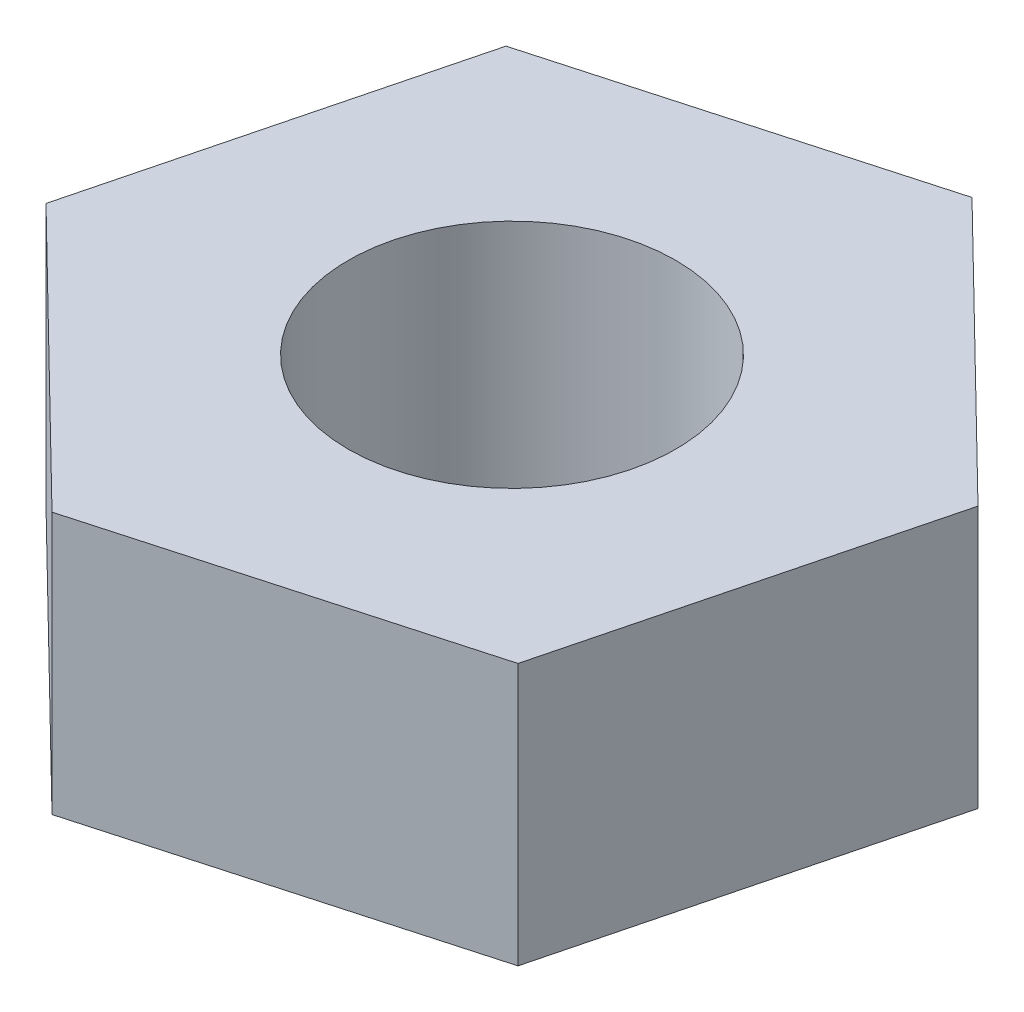
ISO-10303-21;
HEADER;
FILE_DESCRIPTION(('STEP AP214'),'2;1');
FILE_NAME('part.step','',(''),(''),'','','');
FILE_SCHEMA(('AUTOMOTIVE_DESIGN { 1 0 10303 214 1 1 1 1 }'));
ENDSEC;
DATA;
#1=APPLICATION_CONTEXT('core data for automotive mechanical design processes');
#2=APPLICATION_PROTOCOL_DEFINITION('international standard','automotive_design',2000,#1);
#3=PRODUCT_CONTEXT('',#1,'mechanical');
#4=PRODUCT('Part','Part','',(#3));
#5=PRODUCT_RELATED_PRODUCT_CATEGORY('part','',(#4));
#6=PRODUCT_DEFINITION_FORMATION('','',#4);
#7=PRODUCT_DEFINITION_CONTEXT('part definition',#1,'design');
#8=PRODUCT_DEFINITION('design','',#6,#7);
#9=PRODUCT_DEFINITION_SHAPE('','',#8);
#10=(LENGTH_UNIT() NAMED_UNIT(*) SI_UNIT(.MILLI.,.METRE.));
#11=(NAMED_UNIT(*) PLANE_ANGLE_UNIT() SI_UNIT($,.RADIAN.));
#12=(NAMED_UNIT(*) SI_UNIT($,.STERADIAN.) SOLID_ANGLE_UNIT());
#13=UNCERTAINTY_MEASURE_WITH_UNIT(LENGTH_MEASURE(1.E-05),#10,'distance_accuracy_value','');
#14=(GEOMETRIC_REPRESENTATION_CONTEXT(3) GLOBAL_UNCERTAINTY_ASSIGNED_CONTEXT((#13)) GLOBAL_UNIT_ASSIGNED_CONTEXT((#10,
#11,#12)) REPRESENTATION_CONTEXT('',''));
#15=CARTESIAN_POINT('',(0.,0.,0.));
#16=DIRECTION('',(0.,0.,1.));
#17=DIRECTION('',(1.,0.,0.));
#18=AXIS2_PLACEMENT_3D('',#15,#16,#17);
#19=CARTESIAN_POINT('',(0.,1.6,0.));
#20=DIRECTION('',(0.,1.,0.));
#21=DIRECTION('',(0.,0.,1.));
#22=AXIS2_PLACEMENT_3D('',#19,#20,#21);
#23=PLANE('',#22);
#24=DIRECTION('',(0.962956963986224,0.,-0.269655123278668));
#25=VECTOR('',#24,1.);
#26=CARTESIAN_POINT('',(-0.572616678193608,1.6,2.23728484399905));
#27=LINE('',#26,#25);
#28=CARTESIAN_POINT('',(-0.572616678193608,1.6,2.23728484399905));
#29=VERTEX_POINT('',#28);
#30=CARTESIAN_POINT('',(1.65123717130828,1.6,1.61454301194585));
#31=VERTEX_POINT('',#30);
#32=EDGE_CURVE('E146',#29,#31,#27,.T.);
#33=ORIENTED_EDGE('',*,*,#32,.T.);
#34=DIRECTION('',(0.247950294973161,0.,-0.968772755202541));
#35=VECTOR('',#34,1.);
#36=CARTESIAN_POINT('',(1.65123717130828,1.6,1.61454301194585));
#37=LINE('',#36,#35);
#38=CARTESIAN_POINT('',(2.22385384950188,1.6,-0.622741832053203));
#39=VERTEX_POINT('',#38);
#40=EDGE_CURVE('E94',#31,#39,#37,.T.);
#41=ORIENTED_EDGE('',*,*,#40,.T.);
#42=DIRECTION('',(-0.715006669013063,0.,-0.699117631923873));
#43=VECTOR('',#42,1.);
#44=CARTESIAN_POINT('',(2.22385384950188,1.6,-0.622741832053203));
#45=LINE('',#44,#43);
#46=CARTESIAN_POINT('',(0.572616678193607,1.6,-2.23728484399905));
#47=VERTEX_POINT('',#46);
#48=EDGE_CURVE('E107',#39,#47,#45,.T.);
#49=ORIENTED_EDGE('',*,*,#48,.T.);
#50=DIRECTION('',(-0.962956963986224,0.,0.269655123278668));
#51=VECTOR('',#50,1.);
#52=CARTESIAN_POINT('',(0.572616678193607,1.6,-2.23728484399905));
#53=LINE('',#52,#51);
#54=CARTESIAN_POINT('',(-1.65123717130828,1.6,-1.61454301194585));
#55=VERTEX_POINT('',#54);
#56=EDGE_CURVE('E101',#47,#55,#53,.T.);
#57=ORIENTED_EDGE('',*,*,#56,.T.);
#58=DIRECTION('',(-0.247950294973161,0.,0.968772755202541));
#59=VECTOR('',#58,1.);
#60=CARTESIAN_POINT('',(-1.65123717130828,1.6,-1.61454301194585));
#61=LINE('',#60,#59);
#62=CARTESIAN_POINT('',(-2.22385384950188,1.6,0.622741832053203));
#63=VERTEX_POINT('',#62);
#64=EDGE_CURVE('E105',#55,#63,#61,.T.);
#65=ORIENTED_EDGE('',*,*,#64,.T.);
#66=DIRECTION('',(0.715006669013063,0.,0.699117631923873));
#67=VECTOR('',#66,1.);
#68=CARTESIAN_POINT('',(-2.22385384950188,1.6,0.622741832053203));
#69=LINE('',#68,#67);
#70=EDGE_CURVE('E57',#63,#29,#69,.T.);
#71=ORIENTED_EDGE('',*,*,#70,.T.);
#72=EDGE_LOOP('',(#33,#41,#49,#57,#65,#71));
#73=FACE_BOUND('',#72,.T.);
#74=CARTESIAN_POINT('',(0.,1.6,0.));
#75=DIRECTION('',(0.,1.,0.));
#76=DIRECTION('',(0.,0.,1.));
#77=AXIS2_PLACEMENT_3D('',#74,#75,#76);
#78=CIRCLE('',#77,1.);
#79=CARTESIAN_POINT('',(0.,1.6,1.));
#80=VERTEX_POINT('',#79);
#81=EDGE_CURVE('E134',#80,#80,#78,.T.);
#82=ORIENTED_EDGE('',*,*,#81,.F.);
#83=EDGE_LOOP('',(#82));
#84=FACE_BOUND('',#83,.T.);
#85=ADVANCED_FACE('F39',(#73,#84),#23,.T.);
#86=CARTESIAN_POINT('',(0.,0.,0.));
#87=DIRECTION('',(0.,1.,0.));
#88=DIRECTION('',(0.,0.,1.));
#89=AXIS2_PLACEMENT_3D('',#86,#87,#88);
#90=PLANE('',#89);
#91=DIRECTION('',(0.962956963986224,0.,-0.269655123278668));
#92=VECTOR('',#91,1.);
#93=CARTESIAN_POINT('',(-0.572616678193608,0.,2.23728484399905));
#94=LINE('',#93,#92);
#95=CARTESIAN_POINT('',(-0.572616678193608,0.,2.23728484399905));
#96=VERTEX_POINT('',#95);
#97=CARTESIAN_POINT('',(1.65123717130828,0.,1.61454301194585));
#98=VERTEX_POINT('',#97);
#99=EDGE_CURVE('E129',#96,#98,#94,.T.);
#100=ORIENTED_EDGE('',*,*,#99,.F.);
#101=DIRECTION('',(0.715006669013063,0.,0.699117631923873));
#102=VECTOR('',#101,1.);
#103=CARTESIAN_POINT('',(-2.22385384950188,0.,0.622741832053203));
#104=LINE('',#103,#102);
#105=CARTESIAN_POINT('',(-2.22385384950188,0.,0.622741832053203));
#106=VERTEX_POINT('',#105);
#107=EDGE_CURVE('E86',#106,#96,#104,.T.);
#108=ORIENTED_EDGE('',*,*,#107,.F.);
#109=DIRECTION('',(-0.247950294973161,0.,0.968772755202541));
#110=VECTOR('',#109,1.);
#111=CARTESIAN_POINT('',(-1.65123717130828,0.,-1.61454301194585));
#112=LINE('',#111,#110);
#113=CARTESIAN_POINT('',(-1.65123717130828,0.,-1.61454301194585));
#114=VERTEX_POINT('',#113);
#115=EDGE_CURVE('E80',#114,#106,#112,.T.);
#116=ORIENTED_EDGE('',*,*,#115,.F.);
#117=DIRECTION('',(-0.962956963986224,0.,0.269655123278668));
#118=VECTOR('',#117,1.);
#119=CARTESIAN_POINT('',(0.572616678193607,0.,-2.23728484399905));
#120=LINE('',#119,#118);
#121=CARTESIAN_POINT('',(0.572616678193607,0.,-2.23728484399905));
#122=VERTEX_POINT('',#121);
#123=EDGE_CURVE('E116',#122,#114,#120,.T.);
#124=ORIENTED_EDGE('',*,*,#123,.F.);
#125=DIRECTION('',(-0.715006669013063,0.,-0.699117631923873));
#126=VECTOR('',#125,1.);
#127=CARTESIAN_POINT('',(2.22385384950188,0.,-0.622741832053203));
#128=LINE('',#127,#126);
#129=CARTESIAN_POINT('',(2.22385384950188,0.,-0.622741832053203));
#130=VERTEX_POINT('',#129);
#131=EDGE_CURVE('E137',#130,#122,#128,.T.);
#132=ORIENTED_EDGE('',*,*,#131,.F.);
#133=DIRECTION('',(0.247950294973161,0.,-0.968772755202541));
#134=VECTOR('',#133,1.);
#135=CARTESIAN_POINT('',(1.65123717130828,0.,1.61454301194585));
#136=LINE('',#135,#134);
#137=EDGE_CURVE('E133',#98,#130,#136,.T.);
#138=ORIENTED_EDGE('',*,*,#137,.F.);
#139=EDGE_LOOP('',(#100,#108,#116,#124,#132,#138));
#140=FACE_BOUND('',#139,.T.);
#141=CARTESIAN_POINT('',(0.,0.,0.));
#142=DIRECTION('',(0.,1.,0.));
#143=DIRECTION('',(0.,0.,1.));
#144=AXIS2_PLACEMENT_3D('',#141,#142,#143);
#145=CIRCLE('',#144,1.);
#146=CARTESIAN_POINT('',(0.,0.,1.));
#147=VERTEX_POINT('',#146);
#148=EDGE_CURVE('E243',#147,#147,#145,.T.);
#149=ORIENTED_EDGE('',*,*,#148,.T.);
#150=EDGE_LOOP('',(#149));
#151=FACE_BOUND('',#150,.T.);
#152=ADVANCED_FACE('F159',(#140,#151),#90,.F.);
#153=CARTESIAN_POINT('',(-0.572616678193608,1.6,2.23728484399905));
#154=DIRECTION('',(-0.269655123278668,0.,-0.962956963986224));
#155=DIRECTION('',(-0.962956963986224,0.,0.269655123278668));
#156=AXIS2_PLACEMENT_3D('',#153,#154,#155);
#157=PLANE('',#156);
#158=ORIENTED_EDGE('',*,*,#99,.T.);
#159=DIRECTION('',(0.,-1.,0.));
#160=VECTOR('',#159,1.);
#161=CARTESIAN_POINT('',(1.65123717130828,1.6,1.61454301194585));
#162=LINE('',#161,#160);
#163=EDGE_CURVE('E11',#31,#98,#162,.T.);
#164=ORIENTED_EDGE('',*,*,#163,.F.);
#165=ORIENTED_EDGE('',*,*,#32,.F.);
#166=DIRECTION('',(0.,-1.,0.));
#167=VECTOR('',#166,1.);
#168=CARTESIAN_POINT('',(-0.572616678193608,1.6,2.23728484399905));
#169=LINE('',#168,#167);
#170=EDGE_CURVE('E125',#29,#96,#169,.T.);
#171=ORIENTED_EDGE('',*,*,#170,.T.);
#172=EDGE_LOOP('',(#158,#164,#165,#171));
#173=FACE_BOUND('',#172,.T.);
#174=ADVANCED_FACE('F41',(#173),#157,.F.);
#175=CARTESIAN_POINT('',(1.65123717130828,1.6,1.61454301194585));
#176=DIRECTION('',(-0.968772755202541,0.,-0.247950294973161));
#177=DIRECTION('',(-0.247950294973161,0.,0.968772755202541));
#178=AXIS2_PLACEMENT_3D('',#175,#176,#177);
#179=PLANE('',#178);
#180=ORIENTED_EDGE('',*,*,#137,.T.);
#181=DIRECTION('',(0.,-1.,0.));
#182=VECTOR('',#181,1.);
#183=CARTESIAN_POINT('',(2.22385384950188,1.6,-0.622741832053203));
#184=LINE('',#183,#182);
#185=EDGE_CURVE('E49',#39,#130,#184,.T.);
#186=ORIENTED_EDGE('',*,*,#185,.F.);
#187=ORIENTED_EDGE('',*,*,#40,.F.);
#188=ORIENTED_EDGE('',*,*,#163,.T.);
#189=EDGE_LOOP('',(#180,#186,#187,#188));
#190=FACE_BOUND('',#189,.T.);
#191=ADVANCED_FACE('F184',(#190),#179,.F.);
#192=CARTESIAN_POINT('',(2.22385384950188,1.6,-0.622741832053203));
#193=DIRECTION('',(-0.699117631923873,0.,0.715006669013063));
#194=DIRECTION('',(0.715006669013063,0.,0.699117631923873));
#195=AXIS2_PLACEMENT_3D('',#192,#193,#194);
#196=PLANE('',#195);
#197=ORIENTED_EDGE('',*,*,#131,.T.);
#198=DIRECTION('',(0.,-1.,0.));
#199=VECTOR('',#198,1.);
#200=CARTESIAN_POINT('',(0.572616678193607,1.6,-2.23728484399905));
#201=LINE('',#200,#199);
#202=EDGE_CURVE('E118',#47,#122,#201,.T.);
#203=ORIENTED_EDGE('',*,*,#202,.F.);
#204=ORIENTED_EDGE('',*,*,#48,.F.);
#205=ORIENTED_EDGE('',*,*,#185,.T.);
#206=EDGE_LOOP('',(#197,#203,#204,#205));
#207=FACE_BOUND('',#206,.T.);
#208=ADVANCED_FACE('F156',(#207),#196,.F.);
#209=CARTESIAN_POINT('',(0.572616678193607,1.6,-2.23728484399905));
#210=DIRECTION('',(0.269655123278668,0.,0.962956963986224));
#211=DIRECTION('',(0.962956963986224,0.,-0.269655123278668));
#212=AXIS2_PLACEMENT_3D('',#209,#210,#211);
#213=PLANE('',#212);
#214=ORIENTED_EDGE('',*,*,#123,.T.);
#215=DIRECTION('',(0.,-1.,0.));
#216=VECTOR('',#215,1.);
#217=CARTESIAN_POINT('',(-1.65123717130828,1.6,-1.61454301194585));
#218=LINE('',#217,#216);
#219=EDGE_CURVE('E113',#55,#114,#218,.T.);
#220=ORIENTED_EDGE('',*,*,#219,.F.);
#221=ORIENTED_EDGE('',*,*,#56,.F.);
#222=ORIENTED_EDGE('',*,*,#202,.T.);
#223=EDGE_LOOP('',(#214,#220,#221,#222));
#224=FACE_BOUND('',#223,.T.);
#225=ADVANCED_FACE('F114',(#224),#213,.F.);
#226=CARTESIAN_POINT('',(-1.65123717130828,1.6,-1.61454301194585));
#227=DIRECTION('',(0.968772755202541,0.,0.247950294973161));
#228=DIRECTION('',(0.247950294973161,0.,-0.968772755202541));
#229=AXIS2_PLACEMENT_3D('',#226,#227,#228);
#230=PLANE('',#229);
#231=ORIENTED_EDGE('',*,*,#115,.T.);
#232=DIRECTION('',(0.,-1.,0.));
#233=VECTOR('',#232,1.);
#234=CARTESIAN_POINT('',(-2.22385384950188,1.6,0.622741832053203));
#235=LINE('',#234,#233);
#236=EDGE_CURVE('E119',#63,#106,#235,.T.);
#237=ORIENTED_EDGE('',*,*,#236,.F.);
#238=ORIENTED_EDGE('',*,*,#64,.F.);
#239=ORIENTED_EDGE('',*,*,#219,.T.);
#240=EDGE_LOOP('',(#231,#237,#238,#239));
#241=FACE_BOUND('',#240,.T.);
#242=ADVANCED_FACE('F121',(#241),#230,.F.);
#243=CARTESIAN_POINT('',(-2.22385384950188,1.6,0.622741832053203));
#244=DIRECTION('',(0.699117631923873,0.,-0.715006669013063));
#245=DIRECTION('',(-0.715006669013063,0.,-0.699117631923873));
#246=AXIS2_PLACEMENT_3D('',#243,#244,#245);
#247=PLANE('',#246);
#248=ORIENTED_EDGE('',*,*,#107,.T.);
#249=ORIENTED_EDGE('',*,*,#170,.F.);
#250=ORIENTED_EDGE('',*,*,#70,.F.);
#251=ORIENTED_EDGE('',*,*,#236,.T.);
#252=EDGE_LOOP('',(#248,#249,#250,#251));
#253=FACE_BOUND('',#252,.T.);
#254=ADVANCED_FACE('F164',(#253),#247,.F.);
#255=CARTESIAN_POINT('',(0.,1.6,0.));
#256=DIRECTION('',(0.,-1.,0.));
#257=DIRECTION('',(0.,0.,-1.));
#258=AXIS2_PLACEMENT_3D('',#255,#256,#257);
#259=CYLINDRICAL_SURFACE('',#258,1.);
#260=ORIENTED_EDGE('',*,*,#81,.T.);
#261=EDGE_LOOP('',(#260));
#262=FACE_BOUND('',#261,.T.);
#263=ORIENTED_EDGE('',*,*,#148,.F.);
#264=EDGE_LOOP('',(#263));
#265=FACE_BOUND('',#264,.T.);
#266=ADVANCED_FACE('F166',(#262,#265),#259,.F.);
#267=CLOSED_SHELL('',(#85,#152,#174,#191,#208,#225,#242,#254,#266));
#268=MANIFOLD_SOLID_BREP('B2',#267);
#269=ADVANCED_BREP_SHAPE_REPRESENTATION('',(#18,#268),#14);
#270=SHAPE_DEFINITION_REPRESENTATION(#9,#269);
ENDSEC;
END-ISO-10303-21;
